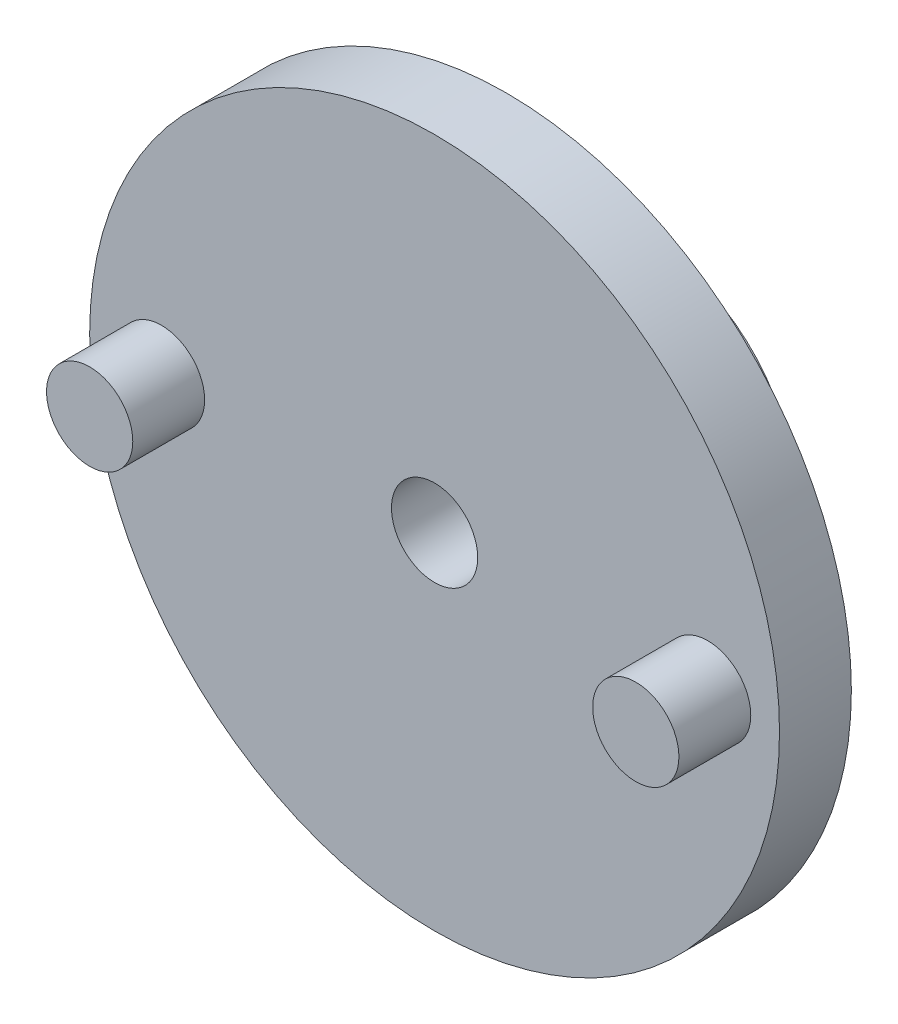
ISO-10303-21;
HEADER;
FILE_DESCRIPTION(('STEP AP214'),'2;1');
FILE_NAME('part.step','',(''),(''),'','','');
FILE_SCHEMA(('AUTOMOTIVE_DESIGN { 1 0 10303 214 1 1 1 1 }'));
ENDSEC;
DATA;
#1=APPLICATION_CONTEXT('core data for automotive mechanical design processes');
#2=APPLICATION_PROTOCOL_DEFINITION('international standard','automotive_design',2000,#1);
#3=PRODUCT_CONTEXT('',#1,'mechanical');
#4=PRODUCT('Part','Part','',(#3));
#5=PRODUCT_RELATED_PRODUCT_CATEGORY('part','',(#4));
#6=PRODUCT_DEFINITION_FORMATION('','',#4);
#7=PRODUCT_DEFINITION_CONTEXT('part definition',#1,'design');
#8=PRODUCT_DEFINITION('design','',#6,#7);
#9=PRODUCT_DEFINITION_SHAPE('','',#8);
#10=(LENGTH_UNIT() NAMED_UNIT(*) SI_UNIT(.MILLI.,.METRE.));
#11=(NAMED_UNIT(*) PLANE_ANGLE_UNIT() SI_UNIT($,.RADIAN.));
#12=(NAMED_UNIT(*) SI_UNIT($,.STERADIAN.) SOLID_ANGLE_UNIT());
#13=UNCERTAINTY_MEASURE_WITH_UNIT(LENGTH_MEASURE(1.E-05),#10,'distance_accuracy_value','');
#14=(GEOMETRIC_REPRESENTATION_CONTEXT(3) GLOBAL_UNCERTAINTY_ASSIGNED_CONTEXT((#13)) GLOBAL_UNIT_ASSIGNED_CONTEXT((#10,
#11,#12)) REPRESENTATION_CONTEXT('',''));
#15=CARTESIAN_POINT('',(0.,0.,0.));
#16=DIRECTION('',(0.,0.,1.));
#17=DIRECTION('',(1.,0.,0.));
#18=AXIS2_PLACEMENT_3D('',#15,#16,#17);
#19=CARTESIAN_POINT('',(0.,0.,2.5));
#20=DIRECTION('',(0.,0.,1.));
#21=DIRECTION('',(1.,0.,0.));
#22=AXIS2_PLACEMENT_3D('',#19,#20,#21);
#23=PLANE('',#22);
#24=CARTESIAN_POINT('',(9.5,0.,2.5));
#25=DIRECTION('',(0.,0.,1.));
#26=DIRECTION('',(1.,0.,0.));
#27=AXIS2_PLACEMENT_3D('',#24,#25,#26);
#28=CIRCLE('',#27,1.5);
#29=CARTESIAN_POINT('',(11.,0.,2.5));
#30=VERTEX_POINT('',#29);
#31=EDGE_CURVE('E60',#30,#30,#28,.T.);
#32=ORIENTED_EDGE('',*,*,#31,.F.);
#33=EDGE_LOOP('',(#32));
#34=FACE_BOUND('',#33,.T.);
#35=CARTESIAN_POINT('',(0.,0.,2.5));
#36=DIRECTION('',(0.,0.,1.));
#37=DIRECTION('',(1.,0.,0.));
#38=AXIS2_PLACEMENT_3D('',#35,#36,#37);
#39=CIRCLE('',#38,1.5);
#40=CARTESIAN_POINT('',(1.5,0.,2.5));
#41=VERTEX_POINT('',#40);
#42=EDGE_CURVE('E56',#41,#41,#39,.T.);
#43=ORIENTED_EDGE('',*,*,#42,.F.);
#44=EDGE_LOOP('',(#43));
#45=FACE_BOUND('',#44,.T.);
#46=CARTESIAN_POINT('',(0.,0.,2.5));
#47=DIRECTION('',(0.,0.,1.));
#48=DIRECTION('',(1.,0.,0.));
#49=AXIS2_PLACEMENT_3D('',#46,#47,#48);
#50=CIRCLE('',#49,12.);
#51=CARTESIAN_POINT('',(12.,0.,2.5));
#52=VERTEX_POINT('',#51);
#53=EDGE_CURVE('E38',#52,#52,#50,.T.);
#54=ORIENTED_EDGE('',*,*,#53,.T.);
#55=EDGE_LOOP('',(#54));
#56=FACE_BOUND('',#55,.T.);
#57=CARTESIAN_POINT('',(-9.5,0.,2.5));
#58=DIRECTION('',(0.,0.,1.));
#59=DIRECTION('',(1.,0.,0.));
#60=AXIS2_PLACEMENT_3D('',#57,#58,#59);
#61=CIRCLE('',#60,1.5);
#62=CARTESIAN_POINT('',(-8.,0.,2.5));
#63=VERTEX_POINT('',#62);
#64=EDGE_CURVE('E66',#63,#63,#61,.T.);
#65=ORIENTED_EDGE('',*,*,#64,.F.);
#66=EDGE_LOOP('',(#65));
#67=FACE_BOUND('',#66,.T.);
#68=ADVANCED_FACE('F30',(#34,#45,#56,#67),#23,.T.);
#69=CARTESIAN_POINT('',(0.,0.,0.));
#70=DIRECTION('',(0.,0.,1.));
#71=DIRECTION('',(1.,0.,0.));
#72=AXIS2_PLACEMENT_3D('',#69,#70,#71);
#73=PLANE('',#72);
#74=CARTESIAN_POINT('',(-9.5,0.,0.));
#75=DIRECTION('',(0.,0.,-1.));
#76=DIRECTION('',(-1.,0.,0.));
#77=AXIS2_PLACEMENT_3D('',#74,#75,#76);
#78=CIRCLE('',#77,0.75);
#79=CARTESIAN_POINT('',(-10.25,0.,0.));
#80=VERTEX_POINT('',#79);
#81=EDGE_CURVE('E78',#80,#80,#78,.T.);
#82=ORIENTED_EDGE('',*,*,#81,.F.);
#83=EDGE_LOOP('',(#82));
#84=FACE_BOUND('',#83,.T.);
#85=CARTESIAN_POINT('',(9.5,0.,0.));
#86=DIRECTION('',(0.,0.,-1.));
#87=DIRECTION('',(-1.,0.,0.));
#88=AXIS2_PLACEMENT_3D('',#85,#86,#87);
#89=CIRCLE('',#88,0.75);
#90=CARTESIAN_POINT('',(8.75,0.,0.));
#91=VERTEX_POINT('',#90);
#92=EDGE_CURVE('E72',#91,#91,#89,.T.);
#93=ORIENTED_EDGE('',*,*,#92,.F.);
#94=EDGE_LOOP('',(#93));
#95=FACE_BOUND('',#94,.T.);
#96=CARTESIAN_POINT('',(0.,0.,0.));
#97=DIRECTION('',(0.,0.,1.));
#98=DIRECTION('',(1.,0.,0.));
#99=AXIS2_PLACEMENT_3D('',#96,#97,#98);
#100=CIRCLE('',#99,12.);
#101=CARTESIAN_POINT('',(12.,0.,0.));
#102=VERTEX_POINT('',#101);
#103=EDGE_CURVE('E42',#102,#102,#100,.T.);
#104=ORIENTED_EDGE('',*,*,#103,.F.);
#105=EDGE_LOOP('',(#104));
#106=FACE_BOUND('',#105,.T.);
#107=CARTESIAN_POINT('',(0.,0.,0.));
#108=DIRECTION('',(0.,0.,1.));
#109=DIRECTION('',(1.,0.,0.));
#110=AXIS2_PLACEMENT_3D('',#107,#108,#109);
#111=CIRCLE('',#110,5.);
#112=CARTESIAN_POINT('',(5.,0.,0.));
#113=VERTEX_POINT('',#112);
#114=EDGE_CURVE('E10',#113,#113,#111,.F.);
#115=ORIENTED_EDGE('',*,*,#114,.F.);
#116=EDGE_LOOP('',(#115));
#117=FACE_BOUND('',#116,.T.);
#118=ADVANCED_FACE('F93',(#84,#95,#106,#117),#73,.F.);
#119=CARTESIAN_POINT('',(0.,0.,2.5));
#120=DIRECTION('',(0.,0.,-1.));
#121=DIRECTION('',(-1.,0.,0.));
#122=AXIS2_PLACEMENT_3D('',#119,#120,#121);
#123=CYLINDRICAL_SURFACE('',#122,12.);
#124=ORIENTED_EDGE('',*,*,#53,.F.);
#125=EDGE_LOOP('',(#124));
#126=FACE_BOUND('',#125,.T.);
#127=ORIENTED_EDGE('',*,*,#103,.T.);
#128=EDGE_LOOP('',(#127));
#129=FACE_BOUND('',#128,.T.);
#130=ADVANCED_FACE('F32',(#126,#129),#123,.T.);
#131=CARTESIAN_POINT('',(0.,0.,-5.));
#132=DIRECTION('',(0.,0.,1.));
#133=DIRECTION('',(1.,0.,0.));
#134=AXIS2_PLACEMENT_3D('',#131,#132,#133);
#135=CYLINDRICAL_SURFACE('',#134,5.);
#136=CARTESIAN_POINT('',(0.,0.,-5.));
#137=DIRECTION('',(0.,0.,-1.));
#138=DIRECTION('',(-1.,0.,0.));
#139=AXIS2_PLACEMENT_3D('',#136,#137,#138);
#140=CIRCLE('',#139,5.);
#141=CARTESIAN_POINT('',(-5.,0.,-5.));
#142=VERTEX_POINT('',#141);
#143=EDGE_CURVE('E46',#142,#142,#140,.T.);
#144=ORIENTED_EDGE('',*,*,#143,.F.);
#145=EDGE_LOOP('',(#144));
#146=FACE_BOUND('',#145,.T.);
#147=ORIENTED_EDGE('',*,*,#114,.T.);
#148=EDGE_LOOP('',(#147));
#149=FACE_BOUND('',#148,.T.);
#150=ADVANCED_FACE('F102',(#146,#149),#135,.T.);
#151=CARTESIAN_POINT('',(0.,0.,-5.));
#152=DIRECTION('',(0.,0.,-1.));
#153=DIRECTION('',(-1.,0.,0.));
#154=AXIS2_PLACEMENT_3D('',#151,#152,#153);
#155=PLANE('',#154);
#156=CARTESIAN_POINT('',(0.,0.,-5.));
#157=DIRECTION('',(0.,0.,-1.));
#158=DIRECTION('',(-1.,0.,0.));
#159=AXIS2_PLACEMENT_3D('',#156,#157,#158);
#160=CIRCLE('',#159,3.1);
#161=CARTESIAN_POINT('',(-3.1,0.,-5.));
#162=VERTEX_POINT('',#161);
#163=EDGE_CURVE('E51',#162,#162,#160,.T.);
#164=ORIENTED_EDGE('',*,*,#163,.F.);
#165=EDGE_LOOP('',(#164));
#166=FACE_BOUND('',#165,.T.);
#167=ORIENTED_EDGE('',*,*,#143,.T.);
#168=EDGE_LOOP('',(#167));
#169=FACE_BOUND('',#168,.T.);
#170=ADVANCED_FACE('F107',(#166,#169),#155,.T.);
#171=CARTESIAN_POINT('',(0.,0.,-0.799999999999999));
#172=DIRECTION('',(0.,0.,-1.));
#173=DIRECTION('',(-1.,0.,0.));
#174=AXIS2_PLACEMENT_3D('',#171,#172,#173);
#175=CYLINDRICAL_SURFACE('',#174,3.1);
#176=CARTESIAN_POINT('',(0.,0.,-0.799999999999999));
#177=DIRECTION('',(0.,0.,-1.));
#178=DIRECTION('',(-1.,0.,0.));
#179=AXIS2_PLACEMENT_3D('',#176,#177,#178);
#180=CIRCLE('',#179,3.1);
#181=CARTESIAN_POINT('',(-3.1,0.,-0.799999999999999));
#182=VERTEX_POINT('',#181);
#183=EDGE_CURVE('E50',#182,#182,#180,.T.);
#184=ORIENTED_EDGE('',*,*,#183,.F.);
#185=EDGE_LOOP('',(#184));
#186=FACE_BOUND('',#185,.T.);
#187=ORIENTED_EDGE('',*,*,#163,.T.);
#188=EDGE_LOOP('',(#187));
#189=FACE_BOUND('',#188,.T.);
#190=ADVANCED_FACE('F121',(#186,#189),#175,.F.);
#191=CARTESIAN_POINT('',(0.,0.,-0.799999999999999));
#192=DIRECTION('',(0.,0.,-1.));
#193=DIRECTION('',(-1.,0.,0.));
#194=AXIS2_PLACEMENT_3D('',#191,#192,#193);
#195=PLANE('',#194);
#196=CARTESIAN_POINT('',(0.,0.,-0.799999999999999));
#197=DIRECTION('',(0.,0.,-1.));
#198=DIRECTION('',(-1.,0.,0.));
#199=AXIS2_PLACEMENT_3D('',#196,#197,#198);
#200=CIRCLE('',#199,1.5);
#201=CARTESIAN_POINT('',(-1.5,0.,-0.799999999999999));
#202=VERTEX_POINT('',#201);
#203=EDGE_CURVE('E34',#202,#202,#200,.T.);
#204=ORIENTED_EDGE('',*,*,#203,.F.);
#205=EDGE_LOOP('',(#204));
#206=FACE_BOUND('',#205,.T.);
#207=ORIENTED_EDGE('',*,*,#183,.T.);
#208=EDGE_LOOP('',(#207));
#209=FACE_BOUND('',#208,.T.);
#210=ADVANCED_FACE('F125',(#206,#209),#195,.T.);
#211=CARTESIAN_POINT('',(0.,0.,-1.5));
#212=DIRECTION('',(0.,0.,1.));
#213=DIRECTION('',(1.,0.,0.));
#214=AXIS2_PLACEMENT_3D('',#211,#212,#213);
#215=CYLINDRICAL_SURFACE('',#214,1.5);
#216=ORIENTED_EDGE('',*,*,#203,.T.);
#217=EDGE_LOOP('',(#216));
#218=FACE_BOUND('',#217,.T.);
#219=ORIENTED_EDGE('',*,*,#42,.T.);
#220=EDGE_LOOP('',(#219));
#221=FACE_BOUND('',#220,.T.);
#222=ADVANCED_FACE('F129',(#218,#221),#215,.F.);
#223=CARTESIAN_POINT('',(9.5,0.,5.));
#224=DIRECTION('',(0.,0.,-1.));
#225=DIRECTION('',(-1.,0.,0.));
#226=AXIS2_PLACEMENT_3D('',#223,#224,#225);
#227=CYLINDRICAL_SURFACE('',#226,1.5);
#228=CARTESIAN_POINT('',(9.5,0.,5.));
#229=DIRECTION('',(0.,0.,1.));
#230=DIRECTION('',(1.,0.,0.));
#231=AXIS2_PLACEMENT_3D('',#228,#229,#230);
#232=CIRCLE('',#231,1.5);
#233=CARTESIAN_POINT('',(11.,0.,5.));
#234=VERTEX_POINT('',#233);
#235=EDGE_CURVE('E59',#234,#234,#232,.T.);
#236=ORIENTED_EDGE('',*,*,#235,.F.);
#237=EDGE_LOOP('',(#236));
#238=FACE_BOUND('',#237,.T.);
#239=ORIENTED_EDGE('',*,*,#31,.T.);
#240=EDGE_LOOP('',(#239));
#241=FACE_BOUND('',#240,.T.);
#242=ADVANCED_FACE('F133',(#238,#241),#227,.T.);
#243=CARTESIAN_POINT('',(9.5,0.,5.));
#244=DIRECTION('',(0.,0.,1.));
#245=DIRECTION('',(1.,0.,0.));
#246=AXIS2_PLACEMENT_3D('',#243,#244,#245);
#247=PLANE('',#246);
#248=ORIENTED_EDGE('',*,*,#235,.T.);
#249=EDGE_LOOP('',(#248));
#250=FACE_BOUND('',#249,.T.);
#251=ADVANCED_FACE('F137',(#250),#247,.T.);
#252=CARTESIAN_POINT('',(-9.5,0.,5.));
#253=DIRECTION('',(0.,0.,-1.));
#254=DIRECTION('',(-1.,0.,0.));
#255=AXIS2_PLACEMENT_3D('',#252,#253,#254);
#256=CYLINDRICAL_SURFACE('',#255,1.5);
#257=CARTESIAN_POINT('',(-9.5,0.,5.));
#258=DIRECTION('',(0.,0.,1.));
#259=DIRECTION('',(1.,0.,0.));
#260=AXIS2_PLACEMENT_3D('',#257,#258,#259);
#261=CIRCLE('',#260,1.5);
#262=CARTESIAN_POINT('',(-8.,0.,5.));
#263=VERTEX_POINT('',#262);
#264=EDGE_CURVE('E63',#263,#263,#261,.T.);
#265=ORIENTED_EDGE('',*,*,#264,.F.);
#266=EDGE_LOOP('',(#265));
#267=FACE_BOUND('',#266,.T.);
#268=ORIENTED_EDGE('',*,*,#64,.T.);
#269=EDGE_LOOP('',(#268));
#270=FACE_BOUND('',#269,.T.);
#271=ADVANCED_FACE('F141',(#267,#270),#256,.T.);
#272=CARTESIAN_POINT('',(-9.5,0.,5.));
#273=DIRECTION('',(0.,0.,1.));
#274=DIRECTION('',(1.,0.,0.));
#275=AXIS2_PLACEMENT_3D('',#272,#273,#274);
#276=PLANE('',#275);
#277=ORIENTED_EDGE('',*,*,#264,.T.);
#278=EDGE_LOOP('',(#277));
#279=FACE_BOUND('',#278,.T.);
#280=ADVANCED_FACE('F145',(#279),#276,.T.);
#281=CARTESIAN_POINT('',(9.5,0.,2.));
#282=DIRECTION('',(0.,0.,-1.));
#283=DIRECTION('',(-1.,0.,0.));
#284=AXIS2_PLACEMENT_3D('',#281,#282,#283);
#285=CYLINDRICAL_SURFACE('',#284,0.75);
#286=CARTESIAN_POINT('',(9.5,0.,2.));
#287=DIRECTION('',(0.,0.,-1.));
#288=DIRECTION('',(-1.,0.,0.));
#289=AXIS2_PLACEMENT_3D('',#286,#287,#288);
#290=CIRCLE('',#289,0.75);
#291=CARTESIAN_POINT('',(8.75,0.,2.));
#292=VERTEX_POINT('',#291);
#293=EDGE_CURVE('E69',#292,#292,#290,.T.);
#294=ORIENTED_EDGE('',*,*,#293,.F.);
#295=EDGE_LOOP('',(#294));
#296=FACE_BOUND('',#295,.T.);
#297=ORIENTED_EDGE('',*,*,#92,.T.);
#298=EDGE_LOOP('',(#297));
#299=FACE_BOUND('',#298,.T.);
#300=ADVANCED_FACE('F149',(#296,#299),#285,.F.);
#301=CARTESIAN_POINT('',(9.5,0.,2.));
#302=DIRECTION('',(0.,0.,-1.));
#303=DIRECTION('',(-1.,0.,0.));
#304=AXIS2_PLACEMENT_3D('',#301,#302,#303);
#305=PLANE('',#304);
#306=ORIENTED_EDGE('',*,*,#293,.T.);
#307=EDGE_LOOP('',(#306));
#308=FACE_BOUND('',#307,.T.);
#309=ADVANCED_FACE('F89',(#308),#305,.T.);
#310=CARTESIAN_POINT('',(-9.5,0.,2.));
#311=DIRECTION('',(0.,0.,-1.));
#312=DIRECTION('',(-1.,0.,0.));
#313=AXIS2_PLACEMENT_3D('',#310,#311,#312);
#314=CYLINDRICAL_SURFACE('',#313,0.75);
#315=CARTESIAN_POINT('',(-9.5,0.,2.));
#316=DIRECTION('',(0.,0.,-1.));
#317=DIRECTION('',(-1.,0.,0.));
#318=AXIS2_PLACEMENT_3D('',#315,#316,#317);
#319=CIRCLE('',#318,0.75);
#320=CARTESIAN_POINT('',(-10.25,0.,2.));
#321=VERTEX_POINT('',#320);
#322=EDGE_CURVE('E75',#321,#321,#319,.T.);
#323=ORIENTED_EDGE('',*,*,#322,.F.);
#324=EDGE_LOOP('',(#323));
#325=FACE_BOUND('',#324,.T.);
#326=ORIENTED_EDGE('',*,*,#81,.T.);
#327=EDGE_LOOP('',(#326));
#328=FACE_BOUND('',#327,.T.);
#329=ADVANCED_FACE('F86',(#325,#328),#314,.F.);
#330=CARTESIAN_POINT('',(-9.5,0.,2.));
#331=DIRECTION('',(0.,0.,-1.));
#332=DIRECTION('',(-1.,0.,0.));
#333=AXIS2_PLACEMENT_3D('',#330,#331,#332);
#334=PLANE('',#333);
#335=ORIENTED_EDGE('',*,*,#322,.T.);
#336=EDGE_LOOP('',(#335));
#337=FACE_BOUND('',#336,.T.);
#338=ADVANCED_FACE('F84',(#337),#334,.T.);
#339=CLOSED_SHELL('',(#68,#118,#130,#150,#170,#190,#210,#222,#242,#251,#271,#280,#300,#309,#329,#338));
#340=MANIFOLD_SOLID_BREP('B2',#339);
#341=ADVANCED_BREP_SHAPE_REPRESENTATION('',(#18,#340),#14);
#342=SHAPE_DEFINITION_REPRESENTATION(#9,#341);
ENDSEC;
END-ISO-10303-21;
